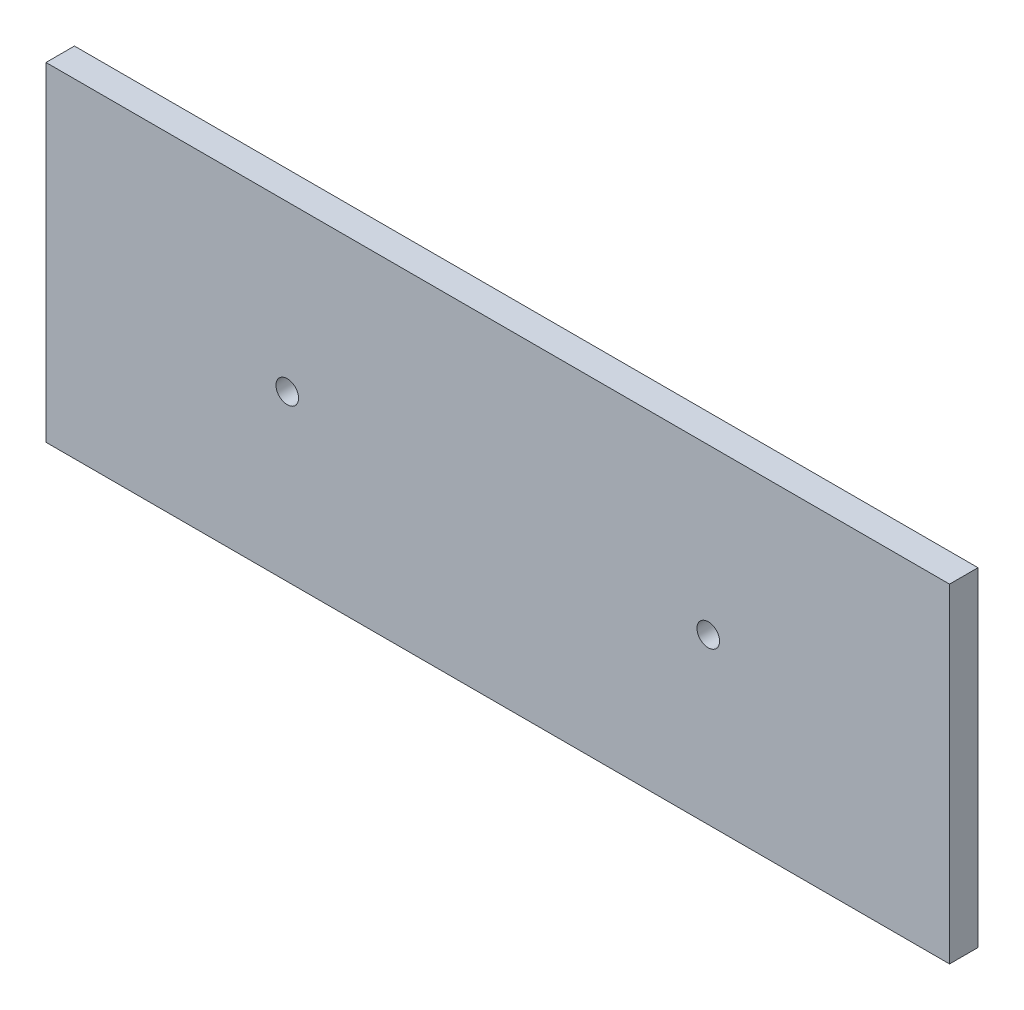
ISO-10303-21;
HEADER;
FILE_DESCRIPTION(('STEP AP214'),'2;1');
FILE_NAME('part.step','',(''),(''),'','','');
FILE_SCHEMA(('AUTOMOTIVE_DESIGN { 1 0 10303 214 1 1 1 1 }'));
ENDSEC;
DATA;
#1=APPLICATION_CONTEXT('core data for automotive mechanical design processes');
#2=APPLICATION_PROTOCOL_DEFINITION('international standard','automotive_design',2000,#1);
#3=PRODUCT_CONTEXT('',#1,'mechanical');
#4=PRODUCT('Part','Part','',(#3));
#5=PRODUCT_RELATED_PRODUCT_CATEGORY('part','',(#4));
#6=PRODUCT_DEFINITION_FORMATION('','',#4);
#7=PRODUCT_DEFINITION_CONTEXT('part definition',#1,'design');
#8=PRODUCT_DEFINITION('design','',#6,#7);
#9=PRODUCT_DEFINITION_SHAPE('','',#8);
#10=(LENGTH_UNIT() NAMED_UNIT(*) SI_UNIT(.MILLI.,.METRE.));
#11=(NAMED_UNIT(*) PLANE_ANGLE_UNIT() SI_UNIT($,.RADIAN.));
#12=(NAMED_UNIT(*) SI_UNIT($,.STERADIAN.) SOLID_ANGLE_UNIT());
#13=UNCERTAINTY_MEASURE_WITH_UNIT(LENGTH_MEASURE(1.E-05),#10,'distance_accuracy_value','');
#14=(GEOMETRIC_REPRESENTATION_CONTEXT(3) GLOBAL_UNCERTAINTY_ASSIGNED_CONTEXT((#13)) GLOBAL_UNIT_ASSIGNED_CONTEXT((#10,
#11,#12)) REPRESENTATION_CONTEXT('',''));
#15=CARTESIAN_POINT('',(0.,0.,0.));
#16=DIRECTION('',(0.,0.,1.));
#17=DIRECTION('',(1.,0.,0.));
#18=AXIS2_PLACEMENT_3D('',#15,#16,#17);
#19=CARTESIAN_POINT('',(91.90870050024,0.,2.));
#20=DIRECTION('',(-1.,0.,0.));
#21=DIRECTION('',(0.,0.,1.));
#22=AXIS2_PLACEMENT_3D('',#19,#20,#21);
#23=PLANE('',#22);
#24=DIRECTION('',(0.,1.,0.));
#25=VECTOR('',#24,1.);
#26=CARTESIAN_POINT('',(91.90870050024,0.,0.));
#27=LINE('',#26,#25);
#28=CARTESIAN_POINT('',(91.90870050024,-29.1468483303805,0.));
#29=VERTEX_POINT('',#28);
#30=CARTESIAN_POINT('',(91.90870050024,-6.02727945685952,0.));
#31=VERTEX_POINT('',#30);
#32=EDGE_CURVE('E103',#29,#31,#27,.T.);
#33=ORIENTED_EDGE('',*,*,#32,.F.);
#34=DIRECTION('',(0.,0.,-1.));
#35=VECTOR('',#34,1.);
#36=CARTESIAN_POINT('',(91.90870050024,-29.1468483303805,2.));
#37=LINE('',#36,#35);
#38=CARTESIAN_POINT('',(91.90870050024,-29.1468483303805,2.));
#39=VERTEX_POINT('',#38);
#40=EDGE_CURVE('E11',#39,#29,#37,.T.);
#41=ORIENTED_EDGE('',*,*,#40,.F.);
#42=DIRECTION('',(0.,1.,0.));
#43=VECTOR('',#42,1.);
#44=CARTESIAN_POINT('',(91.90870050024,0.,2.));
#45=LINE('',#44,#43);
#46=CARTESIAN_POINT('',(91.90870050024,-6.02727945685952,2.));
#47=VERTEX_POINT('',#46);
#48=EDGE_CURVE('E87',#39,#47,#45,.T.);
#49=ORIENTED_EDGE('',*,*,#48,.T.);
#50=DIRECTION('',(0.,0.,-1.));
#51=VECTOR('',#50,1.);
#52=CARTESIAN_POINT('',(91.90870050024,-6.02727945685952,2.));
#53=LINE('',#52,#51);
#54=EDGE_CURVE('E49',#47,#31,#53,.T.);
#55=ORIENTED_EDGE('',*,*,#54,.T.);
#56=EDGE_LOOP('',(#33,#41,#49,#55));
#57=FACE_BOUND('',#56,.T.);
#58=ADVANCED_FACE('F32',(#57),#23,.T.);
#59=CARTESIAN_POINT('',(0.,-29.1468483303805,2.));
#60=DIRECTION('',(0.,1.,0.));
#61=DIRECTION('',(0.,0.,1.));
#62=AXIS2_PLACEMENT_3D('',#59,#60,#61);
#63=PLANE('',#62);
#64=DIRECTION('',(1.,0.,0.));
#65=VECTOR('',#64,1.);
#66=CARTESIAN_POINT('',(0.,-29.1468483303805,0.));
#67=LINE('',#66,#65);
#68=CARTESIAN_POINT('',(155.40870050024,-29.1468483303805,0.));
#69=VERTEX_POINT('',#68);
#70=EDGE_CURVE('E92',#29,#69,#67,.T.);
#71=ORIENTED_EDGE('',*,*,#70,.T.);
#72=DIRECTION('',(0.,0.,-1.));
#73=VECTOR('',#72,1.);
#74=CARTESIAN_POINT('',(155.40870050024,-29.1468483303805,2.));
#75=LINE('',#74,#73);
#76=CARTESIAN_POINT('',(155.40870050024,-29.1468483303805,2.));
#77=VERTEX_POINT('',#76);
#78=EDGE_CURVE('E41',#77,#69,#75,.T.);
#79=ORIENTED_EDGE('',*,*,#78,.F.);
#80=DIRECTION('',(1.,0.,0.));
#81=VECTOR('',#80,1.);
#82=CARTESIAN_POINT('',(0.,-29.1468483303805,2.));
#83=LINE('',#82,#81);
#84=EDGE_CURVE('E83',#39,#77,#83,.T.);
#85=ORIENTED_EDGE('',*,*,#84,.F.);
#86=ORIENTED_EDGE('',*,*,#40,.T.);
#87=EDGE_LOOP('',(#71,#79,#85,#86));
#88=FACE_BOUND('',#87,.T.);
#89=ADVANCED_FACE('F90',(#88),#63,.F.);
#90=CARTESIAN_POINT('',(155.40870050024,0.,2.));
#91=DIRECTION('',(-1.,0.,0.));
#92=DIRECTION('',(0.,0.,1.));
#93=AXIS2_PLACEMENT_3D('',#90,#91,#92);
#94=PLANE('',#93);
#95=DIRECTION('',(0.,1.,0.));
#96=VECTOR('',#95,1.);
#97=CARTESIAN_POINT('',(155.40870050024,0.,0.));
#98=LINE('',#97,#96);
#99=CARTESIAN_POINT('',(155.40870050024,-6.02727945685952,0.));
#100=VERTEX_POINT('',#99);
#101=EDGE_CURVE('E100',#69,#100,#98,.T.);
#102=ORIENTED_EDGE('',*,*,#101,.T.);
#103=DIRECTION('',(0.,0.,-1.));
#104=VECTOR('',#103,1.);
#105=CARTESIAN_POINT('',(155.40870050024,-6.02727945685952,2.));
#106=LINE('',#105,#104);
#107=CARTESIAN_POINT('',(155.40870050024,-6.02727945685952,2.));
#108=VERTEX_POINT('',#107);
#109=EDGE_CURVE('E63',#108,#100,#106,.T.);
#110=ORIENTED_EDGE('',*,*,#109,.F.);
#111=DIRECTION('',(0.,1.,0.));
#112=VECTOR('',#111,1.);
#113=CARTESIAN_POINT('',(155.40870050024,0.,2.));
#114=LINE('',#113,#112);
#115=EDGE_CURVE('E75',#77,#108,#114,.T.);
#116=ORIENTED_EDGE('',*,*,#115,.F.);
#117=ORIENTED_EDGE('',*,*,#78,.T.);
#118=EDGE_LOOP('',(#102,#110,#116,#117));
#119=FACE_BOUND('',#118,.T.);
#120=ADVANCED_FACE('F77',(#119),#94,.F.);
#121=CARTESIAN_POINT('',(138.45208065434,-17.58706389362,2.));
#122=DIRECTION('',(0.,0.,-1.));
#123=DIRECTION('',(-1.,0.,0.));
#124=AXIS2_PLACEMENT_3D('',#121,#122,#123);
#125=CYLINDRICAL_SURFACE('',#124,0.793749999999982);
#126=CARTESIAN_POINT('',(138.45208065434,-17.58706389362,2.));
#127=DIRECTION('',(0.,0.,1.));
#128=DIRECTION('',(1.,0.,0.));
#129=AXIS2_PLACEMENT_3D('',#126,#127,#128);
#130=CIRCLE('',#129,0.793749999999982);
#131=CARTESIAN_POINT('',(139.24583065434,-17.58706389362,2.));
#132=VERTEX_POINT('',#131);
#133=EDGE_CURVE('E113',#132,#132,#130,.T.);
#134=ORIENTED_EDGE('',*,*,#133,.T.);
#135=EDGE_LOOP('',(#134));
#136=FACE_BOUND('',#135,.T.);
#137=CARTESIAN_POINT('',(138.45208065434,-17.58706389362,0.));
#138=DIRECTION('',(0.,0.,1.));
#139=DIRECTION('',(1.,0.,0.));
#140=AXIS2_PLACEMENT_3D('',#137,#138,#139);
#141=CIRCLE('',#140,0.793749999999982);
#142=CARTESIAN_POINT('',(139.24583065434,-17.58706389362,0.));
#143=VERTEX_POINT('',#142);
#144=EDGE_CURVE('E105',#143,#143,#141,.T.);
#145=ORIENTED_EDGE('',*,*,#144,.F.);
#146=EDGE_LOOP('',(#145));
#147=FACE_BOUND('',#146,.T.);
#148=ADVANCED_FACE('F128',(#136,#147),#125,.F.);
#149=CARTESIAN_POINT('',(108.86532034614,-17.58706389362,2.));
#150=DIRECTION('',(0.,0.,-1.));
#151=DIRECTION('',(-1.,0.,0.));
#152=AXIS2_PLACEMENT_3D('',#149,#150,#151);
#153=CYLINDRICAL_SURFACE('',#152,0.793749999999968);
#154=CARTESIAN_POINT('',(108.86532034614,-17.58706389362,2.));
#155=DIRECTION('',(0.,0.,1.));
#156=DIRECTION('',(1.,0.,0.));
#157=AXIS2_PLACEMENT_3D('',#154,#155,#156);
#158=CIRCLE('',#157,0.793749999999968);
#159=CARTESIAN_POINT('',(109.65907034614,-17.58706389362,2.));
#160=VERTEX_POINT('',#159);
#161=EDGE_CURVE('E99',#160,#160,#158,.T.);
#162=ORIENTED_EDGE('',*,*,#161,.T.);
#163=EDGE_LOOP('',(#162));
#164=FACE_BOUND('',#163,.T.);
#165=CARTESIAN_POINT('',(108.86532034614,-17.58706389362,0.));
#166=DIRECTION('',(0.,0.,1.));
#167=DIRECTION('',(1.,0.,0.));
#168=AXIS2_PLACEMENT_3D('',#165,#166,#167);
#169=CIRCLE('',#168,0.793749999999968);
#170=CARTESIAN_POINT('',(109.65907034614,-17.58706389362,0.));
#171=VERTEX_POINT('',#170);
#172=EDGE_CURVE('E108',#171,#171,#169,.T.);
#173=ORIENTED_EDGE('',*,*,#172,.F.);
#174=EDGE_LOOP('',(#173));
#175=FACE_BOUND('',#174,.T.);
#176=ADVANCED_FACE('F34',(#164,#175),#153,.F.);
#177=CARTESIAN_POINT('',(0.,-6.02727945685952,2.));
#178=DIRECTION('',(0.,1.,0.));
#179=DIRECTION('',(0.,0.,1.));
#180=AXIS2_PLACEMENT_3D('',#177,#178,#179);
#181=PLANE('',#180);
#182=DIRECTION('',(1.,0.,0.));
#183=VECTOR('',#182,1.);
#184=CARTESIAN_POINT('',(0.,-6.02727945685952,0.));
#185=LINE('',#184,#183);
#186=EDGE_CURVE('E96',#31,#100,#185,.T.);
#187=ORIENTED_EDGE('',*,*,#186,.F.);
#188=ORIENTED_EDGE('',*,*,#54,.F.);
#189=DIRECTION('',(1.,0.,0.));
#190=VECTOR('',#189,1.);
#191=CARTESIAN_POINT('',(0.,-6.02727945685952,2.));
#192=LINE('',#191,#190);
#193=EDGE_CURVE('E82',#47,#108,#192,.T.);
#194=ORIENTED_EDGE('',*,*,#193,.T.);
#195=ORIENTED_EDGE('',*,*,#109,.T.);
#196=EDGE_LOOP('',(#187,#188,#194,#195));
#197=FACE_BOUND('',#196,.T.);
#198=ADVANCED_FACE('F124',(#197),#181,.T.);
#199=CARTESIAN_POINT('',(0.,0.,2.));
#200=DIRECTION('',(0.,0.,1.));
#201=DIRECTION('',(1.,0.,0.));
#202=AXIS2_PLACEMENT_3D('',#199,#200,#201);
#203=PLANE('',#202);
#204=ORIENTED_EDGE('',*,*,#161,.F.);
#205=EDGE_LOOP('',(#204));
#206=FACE_BOUND('',#205,.T.);
#207=ORIENTED_EDGE('',*,*,#133,.F.);
#208=EDGE_LOOP('',(#207));
#209=FACE_BOUND('',#208,.T.);
#210=ORIENTED_EDGE('',*,*,#48,.F.);
#211=ORIENTED_EDGE('',*,*,#84,.T.);
#212=ORIENTED_EDGE('',*,*,#115,.T.);
#213=ORIENTED_EDGE('',*,*,#193,.F.);
#214=EDGE_LOOP('',(#210,#211,#212,#213));
#215=FACE_BOUND('',#214,.T.);
#216=ADVANCED_FACE('F86',(#206,#209,#215),#203,.T.);
#217=CARTESIAN_POINT('',(0.,0.,0.));
#218=DIRECTION('',(0.,0.,1.));
#219=DIRECTION('',(1.,0.,0.));
#220=AXIS2_PLACEMENT_3D('',#217,#218,#219);
#221=PLANE('',#220);
#222=ORIENTED_EDGE('',*,*,#172,.T.);
#223=EDGE_LOOP('',(#222));
#224=FACE_BOUND('',#223,.T.);
#225=ORIENTED_EDGE('',*,*,#144,.T.);
#226=EDGE_LOOP('',(#225));
#227=FACE_BOUND('',#226,.T.);
#228=ORIENTED_EDGE('',*,*,#32,.T.);
#229=ORIENTED_EDGE('',*,*,#186,.T.);
#230=ORIENTED_EDGE('',*,*,#101,.F.);
#231=ORIENTED_EDGE('',*,*,#70,.F.);
#232=EDGE_LOOP('',(#228,#229,#230,#231));
#233=FACE_BOUND('',#232,.T.);
#234=ADVANCED_FACE('F123',(#224,#227,#233),#221,.F.);
#235=CLOSED_SHELL('',(#58,#89,#120,#148,#176,#198,#216,#234));
#236=MANIFOLD_SOLID_BREP('B2',#235);
#237=ADVANCED_BREP_SHAPE_REPRESENTATION('',(#18,#236),#14);
#238=SHAPE_DEFINITION_REPRESENTATION(#9,#237);
ENDSEC;
END-ISO-10303-21;
